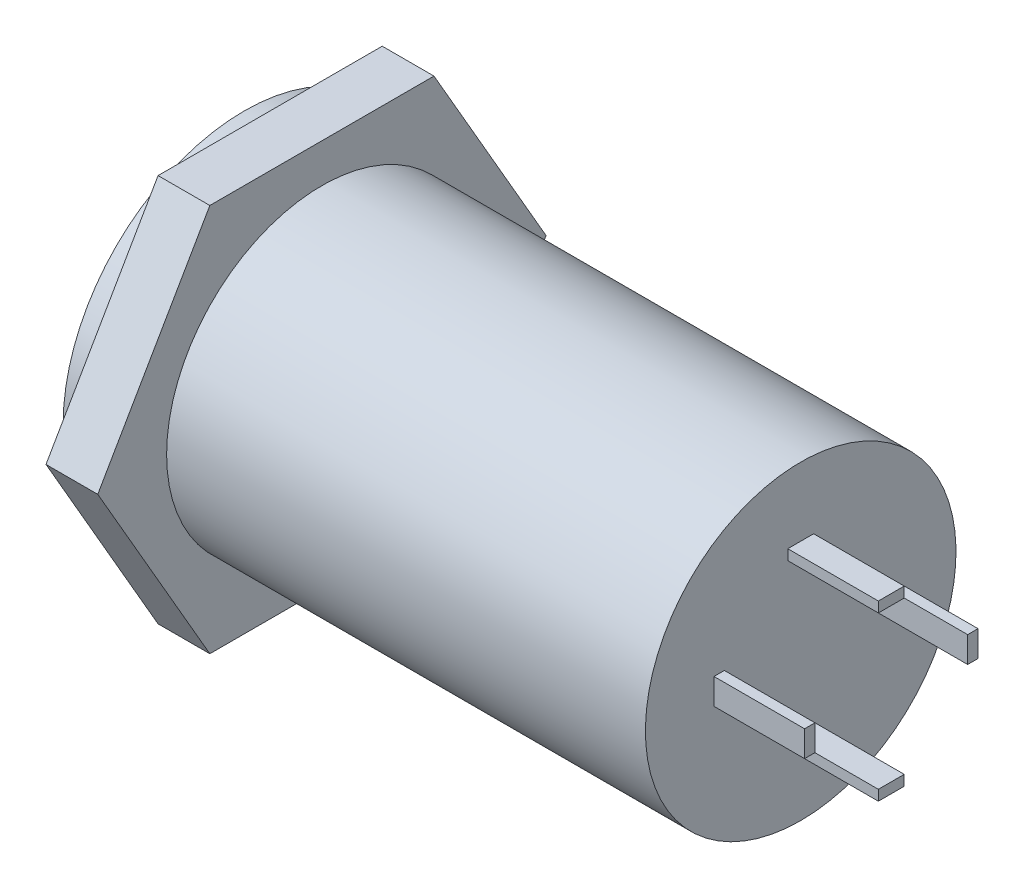
ISO-10303-21;
HEADER;
FILE_DESCRIPTION(('STEP AP214'),'2;1');
FILE_NAME('part.step','',(''),(''),'','','');
FILE_SCHEMA(('AUTOMOTIVE_DESIGN { 1 0 10303 214 1 1 1 1 }'));
ENDSEC;
DATA;
#1=APPLICATION_CONTEXT('core data for automotive mechanical design processes');
#2=APPLICATION_PROTOCOL_DEFINITION('international standard','automotive_design',2000,#1);
#3=PRODUCT_CONTEXT('',#1,'mechanical');
#4=PRODUCT('Part','Part','',(#3));
#5=PRODUCT_RELATED_PRODUCT_CATEGORY('part','',(#4));
#6=PRODUCT_DEFINITION_FORMATION('','',#4);
#7=PRODUCT_DEFINITION_CONTEXT('part definition',#1,'design');
#8=PRODUCT_DEFINITION('design','',#6,#7);
#9=PRODUCT_DEFINITION_SHAPE('','',#8);
#10=(LENGTH_UNIT() NAMED_UNIT(*) SI_UNIT(.MILLI.,.METRE.));
#11=(NAMED_UNIT(*) PLANE_ANGLE_UNIT() SI_UNIT($,.RADIAN.));
#12=(NAMED_UNIT(*) SI_UNIT($,.STERADIAN.) SOLID_ANGLE_UNIT());
#13=UNCERTAINTY_MEASURE_WITH_UNIT(LENGTH_MEASURE(1.E-05),#10,'distance_accuracy_value','');
#14=(GEOMETRIC_REPRESENTATION_CONTEXT(3) GLOBAL_UNCERTAINTY_ASSIGNED_CONTEXT((#13)) GLOBAL_UNIT_ASSIGNED_CONTEXT((#10,
#11,#12)) REPRESENTATION_CONTEXT('',''));
#15=CARTESIAN_POINT('',(0.,0.,0.));
#16=DIRECTION('',(0.,0.,1.));
#17=DIRECTION('',(1.,0.,0.));
#18=AXIS2_PLACEMENT_3D('',#15,#16,#17);
#19=CARTESIAN_POINT('',(181.999927093062,30.1313150027358,44.5613097333414));
#20=DIRECTION('',(-0.999999999998967,-1.43736455550827E-06,-1.04345780020987E-12));
#21=DIRECTION('',(1.43736455550827E-06,-0.999999999998967,0.));
#22=AXIS2_PLACEMENT_3D('',#19,#20,#21);
#23=PLANE('',#22);
#24=DIRECTION('',(0.,7.25952093577634E-07,-0.999999999999737));
#25=VECTOR('',#24,1.);
#26=CARTESIAN_POINT('',(181.999927811709,29.6313387192516,44.5613093703825));
#27=LINE('',#26,#25);
#28=CARTESIAN_POINT('',(181.999927811709,29.6313408608103,41.6113093703833));
#29=VERTEX_POINT('',#28);
#30=CARTESIAN_POINT('',(181.999927811709,29.6313411511911,41.2113093703834));
#31=VERTEX_POINT('',#30);
#32=EDGE_CURVE('E160',#29,#31,#27,.T.);
#33=ORIENTED_EDGE('',*,*,#32,.F.);
#34=DIRECTION('',(1.4373645329524E-06,-0.999999999998703,-7.25952097047067E-07));
#35=VECTOR('',#34,1.);
#36=CARTESIAN_POINT('',(181.999926374379,30.6313171442938,41.6113100963182));
#37=LINE('',#36,#35);
#38=CARTESIAN_POINT('',(181.999926374345,30.631340860809,41.6113100963354));
#39=VERTEX_POINT('',#38);
#40=EDGE_CURVE('E170',#39,#29,#37,.T.);
#41=ORIENTED_EDGE('',*,*,#40,.F.);
#42=DIRECTION('',(0.,-7.25952102251239E-07,0.999999999999737));
#43=VECTOR('',#42,1.);
#44=CARTESIAN_POINT('',(181.999926374345,30.6313387192503,44.5613100963347));
#45=LINE('',#44,#43);
#46=CARTESIAN_POINT('',(181.999926374345,30.6313411511899,41.2113100963355));
#47=VERTEX_POINT('',#46);
#48=EDGE_CURVE('E167',#47,#39,#45,.T.);
#49=ORIENTED_EDGE('',*,*,#48,.F.);
#50=DIRECTION('',(-1.43736450519683E-06,0.999999999998703,7.25952090108173E-07));
#51=VECTOR('',#50,1.);
#52=CARTESIAN_POINT('',(181.999927811743,29.6313174346759,41.2113093703662));
#53=LINE('',#52,#51);
#54=EDGE_CURVE('E163',#31,#47,#53,.T.);
#55=ORIENTED_EDGE('',*,*,#54,.F.);
#56=EDGE_LOOP('',(#33,#41,#49,#55));
#57=FACE_BOUND('',#56,.T.);
#58=DIRECTION('',(0.,-7.25952090108177E-07,0.999999999999737));
#59=VECTOR('',#58,1.);
#60=CARTESIAN_POINT('',(181.999922277856,33.4813387192467,44.5613121652981));
#61=LINE('',#60,#59);
#62=CARTESIAN_POINT('',(181.999922277856,33.4813390822227,44.0613121652983));
#63=VERTEX_POINT('',#62);
#64=CARTESIAN_POINT('',(181.999922277856,33.4813383562706,45.061312165298));
#65=VERTEX_POINT('',#64);
#66=EDGE_CURVE('E174',#63,#65,#61,.T.);
#67=ORIENTED_EDGE('',*,*,#66,.F.);
#68=DIRECTION('',(-1.43736453295242E-06,0.999999999998703,7.25952093577627E-07));
#69=VECTOR('',#68,1.);
#70=CARTESIAN_POINT('',(181.999922852836,33.0813153657081,44.0613118749002));
#71=LINE('',#70,#69);
#72=CARTESIAN_POINT('',(181.999922852802,33.0813390822232,44.0613118749174));
#73=VERTEX_POINT('',#72);
#74=EDGE_CURVE('E184',#73,#63,#71,.T.);
#75=ORIENTED_EDGE('',*,*,#74,.F.);
#76=DIRECTION('',(0.,7.25952097047071E-07,-0.999999999999737));
#77=VECTOR('',#76,1.);
#78=CARTESIAN_POINT('',(181.999922852802,33.0813387192471,44.5613118749173));
#79=LINE('',#78,#77);
#80=CARTESIAN_POINT('',(181.999922852802,33.0813383562711,45.0613118749171));
#81=VERTEX_POINT('',#80);
#82=EDGE_CURVE('E181',#81,#73,#79,.T.);
#83=ORIENTED_EDGE('',*,*,#82,.F.);
#84=DIRECTION('',(1.43736453295239E-06,-0.999999999998703,-7.25952093577615E-07));
#85=VECTOR('',#84,1.);
#86=CARTESIAN_POINT('',(181.99992227789,33.4813146397554,45.0613121652807));
#87=LINE('',#86,#85);
#88=EDGE_CURVE('E177',#65,#81,#87,.T.);
#89=ORIENTED_EDGE('',*,*,#88,.F.);
#90=EDGE_LOOP('',(#67,#75,#83,#89));
#91=FACE_BOUND('',#90,.T.);
#92=CARTESIAN_POINT('',(181.999927093027,30.131338719251,44.5613097333586));
#93=DIRECTION('',(-0.999999999998967,-1.43736455550827E-06,-1.04345780020987E-12));
#94=DIRECTION('',(1.43736455550827E-06,-0.999999999998967,0.));
#95=AXIS2_PLACEMENT_3D('',#92,#93,#94);
#96=CIRCLE('',#95,6.);
#97=CARTESIAN_POINT('',(181.999935717214,24.1313387192572,44.5613097333586));
#98=VERTEX_POINT('',#97);
#99=EDGE_CURVE('E188',#98,#98,#96,.T.);
#100=ORIENTED_EDGE('',*,*,#99,.F.);
#101=EDGE_LOOP('',(#100));
#102=FACE_BOUND('',#101,.T.);
#103=DIRECTION('',(0.,7.2595208490403E-07,-0.999999999999737));
#104=VECTOR('',#103,1.);
#105=CARTESIAN_POINT('',(181.999927811709,29.6313387192516,44.5613093703825));
#106=LINE('',#105,#104);
#107=CARTESIAN_POINT('',(181.999927811709,29.6313362873121,47.9113093703816));
#108=VERTEX_POINT('',#107);
#109=CARTESIAN_POINT('',(181.999927811709,29.6313365776929,47.5113093703817));
#110=VERTEX_POINT('',#109);
#111=EDGE_CURVE('E192',#108,#110,#106,.T.);
#112=ORIENTED_EDGE('',*,*,#111,.F.);
#113=DIRECTION('',(1.4373645329524E-06,-0.999999999998703,-7.25952103985961E-07));
#114=VECTOR('',#113,1.);
#115=CARTESIAN_POINT('',(181.999926374379,30.6313125707957,47.9113100963165));
#116=LINE('',#115,#114);
#117=CARTESIAN_POINT('',(181.999926374345,30.6313362873108,47.9113100963337));
#118=VERTEX_POINT('',#117);
#119=EDGE_CURVE('E202',#118,#108,#116,.T.);
#120=ORIENTED_EDGE('',*,*,#119,.F.);
#121=DIRECTION('',(0.,-7.25952084904017E-07,0.999999999999737));
#122=VECTOR('',#121,1.);
#123=CARTESIAN_POINT('',(181.999926374345,30.6313387192503,44.5613100963347));
#124=LINE('',#123,#122);
#125=CARTESIAN_POINT('',(181.999926374345,30.6313365776916,47.5113100963338));
#126=VERTEX_POINT('',#125);
#127=EDGE_CURVE('E199',#126,#118,#124,.T.);
#128=ORIENTED_EDGE('',*,*,#127,.F.);
#129=DIRECTION('',(-1.43736450519683E-06,0.999999999998703,7.25952090108173E-07));
#130=VECTOR('',#129,1.);
#131=CARTESIAN_POINT('',(181.999927811743,29.6313128611778,47.5113093703645));
#132=LINE('',#131,#130);
#133=EDGE_CURVE('E195',#110,#126,#132,.T.);
#134=ORIENTED_EDGE('',*,*,#133,.F.);
#135=EDGE_LOOP('',(#112,#120,#128,#134));
#136=FACE_BOUND('',#135,.T.);
#137=DIRECTION('',(0.,7.25952090108177E-07,-0.999999999999737));
#138=VECTOR('',#137,1.);
#139=CARTESIAN_POINT('',(181.999931908199,26.7813387192554,44.5613073014191));
#140=LINE('',#139,#138);
#141=CARTESIAN_POINT('',(181.999931908199,26.7813383562793,45.061307301419));
#142=VERTEX_POINT('',#141);
#143=CARTESIAN_POINT('',(181.999931908199,26.7813390822314,44.0613073014192));
#144=VERTEX_POINT('',#143);
#145=EDGE_CURVE('E36',#142,#144,#140,.T.);
#146=ORIENTED_EDGE('',*,*,#145,.F.);
#147=DIRECTION('',(1.43736460234137E-06,-0.999999999998703,-7.25952110924869E-07));
#148=VECTOR('',#147,1.);
#149=CARTESIAN_POINT('',(181.999931333287,27.1813146397636,45.0613075917826));
#150=LINE('',#149,#148);
#151=CARTESIAN_POINT('',(181.999931333253,27.1813383562787,45.0613075917998));
#152=VERTEX_POINT('',#151);
#153=EDGE_CURVE('E213',#152,#142,#150,.T.);
#154=ORIENTED_EDGE('',*,*,#153,.F.);
#155=DIRECTION('',(0.,-7.25952093577624E-07,0.999999999999737));
#156=VECTOR('',#155,1.);
#157=CARTESIAN_POINT('',(181.999931333253,27.1813387192548,44.5613075917999));
#158=LINE('',#157,#156);
#159=CARTESIAN_POINT('',(181.999931333253,27.1813390822308,44.0613075918));
#160=VERTEX_POINT('',#159);
#161=EDGE_CURVE('E210',#160,#152,#158,.T.);
#162=ORIENTED_EDGE('',*,*,#161,.F.);
#163=DIRECTION('',(-1.43736460234135E-06,0.999999999998703,7.25952110924862E-07));
#164=VECTOR('',#163,1.);
#165=CARTESIAN_POINT('',(181.999931908232,26.7813153657162,44.061307301402));
#166=LINE('',#165,#164);
#167=EDGE_CURVE('E207',#144,#160,#166,.T.);
#168=ORIENTED_EDGE('',*,*,#167,.F.);
#169=EDGE_LOOP('',(#146,#154,#162,#168));
#170=FACE_BOUND('',#169,.T.);
#171=ADVANCED_FACE('F17',(#57,#91,#102,#136,#170),#23,.F.);
#172=CARTESIAN_POINT('',(156.499937873305,22.6313052099292,40.2311772697703));
#173=DIRECTION('',(-1.43736455550865E-06,0.999999999998703,7.25952088390623E-07));
#174=DIRECTION('',(-0.999999999998967,-1.43736455550902E-06,0.));
#175=AXIS2_PLACEMENT_3D('',#172,#173,#174);
#176=PLANE('',#175);
#177=DIRECTION('',(0.,-7.25952088391373E-07,0.999999999999737));
#178=VECTOR('',#177,1.);
#179=CARTESIAN_POINT('',(163.499937873302,22.6313080846583,40.2311772697725));
#180=LINE('',#179,#178);
#181=CARTESIAN_POINT('',(163.499937873302,22.6313080846583,40.2311772697725));
#182=VERTEX_POINT('',#181);
#183=CARTESIAN_POINT('',(163.499937873302,22.6313017977288,48.8914313076145));
#184=VERTEX_POINT('',#183);
#185=EDGE_CURVE('E151',#182,#184,#180,.T.);
#186=ORIENTED_EDGE('',*,*,#185,.T.);
#187=DIRECTION('',(0.999999999998967,1.43736455550827E-06,1.04345780031575E-12));
#188=VECTOR('',#187,1.);
#189=CARTESIAN_POINT('',(156.499937873305,22.6312989229997,48.8914313076124));
#190=LINE('',#189,#188);
#191=CARTESIAN_POINT('',(161.499937873305,22.6312989229997,48.8914313076124));
#192=VERTEX_POINT('',#191);
#193=EDGE_CURVE('E27',#192,#184,#190,.T.);
#194=ORIENTED_EDGE('',*,*,#193,.F.);
#195=DIRECTION('',(0.,-7.25952088391373E-07,0.999999999999737));
#196=VECTOR('',#195,1.);
#197=CARTESIAN_POINT('',(161.499937873305,22.6313052099292,40.2311772697703));
#198=LINE('',#197,#196);
#199=CARTESIAN_POINT('',(161.499937873305,22.6313052099292,40.2311772697703));
#200=VERTEX_POINT('',#199);
#201=EDGE_CURVE('E139',#200,#192,#198,.T.);
#202=ORIENTED_EDGE('',*,*,#201,.F.);
#203=DIRECTION('',(0.999999999998967,1.43736455550827E-06,1.04345780031575E-12));
#204=VECTOR('',#203,1.);
#205=CARTESIAN_POINT('',(156.499937873305,22.6313052099292,40.2311772697703));
#206=LINE('',#205,#204);
#207=EDGE_CURVE('E157',#200,#182,#206,.T.);
#208=ORIENTED_EDGE('',*,*,#207,.T.);
#209=EDGE_LOOP('',(#186,#194,#202,#208));
#210=FACE_BOUND('',#209,.T.);
#211=ADVANCED_FACE('F149',(#210),#176,.F.);
#212=CARTESIAN_POINT('',(156.499937873305,22.6312989229998,48.8914313076124));
#213=DIRECTION('',(-7.18682277754329E-07,0.500000628692305,-0.866025040808165));
#214=DIRECTION('',(0.,0.866025040808388,0.500000628692435));
#215=AXIS2_PLACEMENT_3D('',#212,#213,#214);
#216=PLANE('',#215);
#217=DIRECTION('',(-1.24479421766269E-06,0.86602504080727,0.500000628692822));
#218=VECTOR('',#217,1.);
#219=CARTESIAN_POINT('',(163.499937873302,22.6313017977289,48.8914313076145));
#220=LINE('',#219,#218);
#221=CARTESIAN_POINT('',(163.499927093068,30.1312986542544,53.2215637711762));
#222=VERTEX_POINT('',#221);
#223=EDGE_CURVE('E256',#184,#222,#220,.T.);
#224=ORIENTED_EDGE('',*,*,#223,.T.);
#225=DIRECTION('',(0.999999999998967,1.43736455550827E-06,1.04345780031575E-12));
#226=VECTOR('',#225,1.);
#227=CARTESIAN_POINT('',(156.499927093071,30.1312957795253,53.2215637711741));
#228=LINE('',#227,#226);
#229=CARTESIAN_POINT('',(161.49992709307,30.1312957795253,53.2215637711741));
#230=VERTEX_POINT('',#229);
#231=EDGE_CURVE('E136',#230,#222,#228,.T.);
#232=ORIENTED_EDGE('',*,*,#231,.F.);
#233=DIRECTION('',(-1.24479421766269E-06,0.86602504080727,0.500000628692822));
#234=VECTOR('',#233,1.);
#235=CARTESIAN_POINT('',(161.499937873305,22.6312989229998,48.8914313076124));
#236=LINE('',#235,#234);
#237=EDGE_CURVE('E21',#192,#230,#236,.T.);
#238=ORIENTED_EDGE('',*,*,#237,.F.);
#239=ORIENTED_EDGE('',*,*,#193,.T.);
#240=EDGE_LOOP('',(#224,#232,#238,#239));
#241=FACE_BOUND('',#240,.T.);
#242=ADVANCED_FACE('F132',(#241),#216,.F.);
#243=CARTESIAN_POINT('',(156.499927093071,30.1312957795253,53.2215637711741));
#244=DIRECTION('',(7.18682277754319E-07,-0.499999371306399,-0.866025766760256));
#245=DIRECTION('',(0.,0.86602576676048,-0.499999371306528));
#246=AXIS2_PLACEMENT_3D('',#243,#244,#245);
#247=PLANE('',#246);
#248=DIRECTION('',(-1.24479422086763E-06,0.866025766759361,-0.499999371306916));
#249=VECTOR('',#248,1.);
#250=CARTESIAN_POINT('',(163.499927093068,30.1312986542544,53.2215637711762));
#251=LINE('',#250,#249);
#252=CARTESIAN_POINT('',(163.499916312835,37.6313017977095,48.8914421968958));
#253=VERTEX_POINT('',#252);
#254=EDGE_CURVE('E258',#222,#253,#251,.T.);
#255=ORIENTED_EDGE('',*,*,#254,.T.);
#256=DIRECTION('',(0.999999999998967,1.43736455550827E-06,1.04345780031575E-12));
#257=VECTOR('',#256,1.);
#258=CARTESIAN_POINT('',(156.499916312837,37.6312989229803,48.8914421968937));
#259=LINE('',#258,#257);
#260=CARTESIAN_POINT('',(161.499916312836,37.6312989229803,48.8914421968937));
#261=VERTEX_POINT('',#260);
#262=EDGE_CURVE('E153',#261,#253,#259,.T.);
#263=ORIENTED_EDGE('',*,*,#262,.F.);
#264=DIRECTION('',(-1.24479422086763E-06,0.866025766759361,-0.499999371306916));
#265=VECTOR('',#264,1.);
#266=CARTESIAN_POINT('',(161.49992709307,30.1312957795253,53.2215637711741));
#267=LINE('',#266,#265);
#268=EDGE_CURVE('E138',#230,#261,#267,.T.);
#269=ORIENTED_EDGE('',*,*,#268,.F.);
#270=ORIENTED_EDGE('',*,*,#231,.T.);
#271=EDGE_LOOP('',(#255,#263,#269,#270));
#272=FACE_BOUND('',#271,.T.);
#273=ADVANCED_FACE('F277',(#272),#247,.F.);
#274=CARTESIAN_POINT('',(156.499916312837,37.6312989229803,48.8914421968937));
#275=DIRECTION('',(1.43736455550865E-06,-0.999999999998703,-7.25952088390622E-07));
#276=DIRECTION('',(0.999999999998967,1.43736455550902E-06,0.));
#277=AXIS2_PLACEMENT_3D('',#274,#275,#276);
#278=PLANE('',#277);
#279=DIRECTION('',(0.,7.25952088391372E-07,-0.999999999999737));
#280=VECTOR('',#279,1.);
#281=CARTESIAN_POINT('',(163.499916312835,37.6313017977095,48.8914421968958));
#282=LINE('',#281,#280);
#283=CARTESIAN_POINT('',(163.499916312835,37.631308084639,40.2311881590537));
#284=VERTEX_POINT('',#283);
#285=EDGE_CURVE('E260',#253,#284,#282,.T.);
#286=ORIENTED_EDGE('',*,*,#285,.T.);
#287=DIRECTION('',(0.999999999998967,1.43736455550827E-06,1.04345780031575E-12));
#288=VECTOR('',#287,1.);
#289=CARTESIAN_POINT('',(156.499916312837,37.6313052099098,40.2311881590516));
#290=LINE('',#289,#288);
#291=CARTESIAN_POINT('',(161.499916312836,37.6313052099098,40.2311881590516));
#292=VERTEX_POINT('',#291);
#293=EDGE_CURVE('E281',#292,#284,#290,.T.);
#294=ORIENTED_EDGE('',*,*,#293,.F.);
#295=DIRECTION('',(0.,7.25952088391372E-07,-0.999999999999737));
#296=VECTOR('',#295,1.);
#297=CARTESIAN_POINT('',(161.499916312836,37.6312989229803,48.8914421968937));
#298=LINE('',#297,#296);
#299=EDGE_CURVE('E271',#261,#292,#298,.T.);
#300=ORIENTED_EDGE('',*,*,#299,.F.);
#301=ORIENTED_EDGE('',*,*,#262,.T.);
#302=EDGE_LOOP('',(#286,#294,#300,#301));
#303=FACE_BOUND('',#302,.T.);
#304=ADVANCED_FACE('F282',(#303),#278,.F.);
#305=CARTESIAN_POINT('',(156.499916312837,37.6313052099098,40.2311881590516));
#306=DIRECTION('',(7.18682277754324E-07,-0.500000628692303,0.866025040808166));
#307=DIRECTION('',(0.,-0.86602504080839,-0.500000628692432));
#308=AXIS2_PLACEMENT_3D('',#305,#306,#307);
#309=PLANE('',#308);
#310=DIRECTION('',(1.24479421766269E-06,-0.866025040807271,-0.500000628692819));
#311=VECTOR('',#310,1.);
#312=CARTESIAN_POINT('',(163.499916312835,37.631308084639,40.2311881590537));
#313=LINE('',#312,#311);
#314=CARTESIAN_POINT('',(163.499927093068,30.1313112281135,35.901055695492));
#315=VERTEX_POINT('',#314);
#316=EDGE_CURVE('E262',#284,#315,#313,.T.);
#317=ORIENTED_EDGE('',*,*,#316,.T.);
#318=DIRECTION('',(0.999999999998967,1.43736455550827E-06,1.04345780031575E-12));
#319=VECTOR('',#318,1.);
#320=CARTESIAN_POINT('',(156.499927093071,30.1313083533843,35.9010556954899));
#321=LINE('',#320,#319);
#322=CARTESIAN_POINT('',(161.49992709307,30.1313083533843,35.9010556954899));
#323=VERTEX_POINT('',#322);
#324=EDGE_CURVE('E159',#323,#315,#321,.T.);
#325=ORIENTED_EDGE('',*,*,#324,.F.);
#326=DIRECTION('',(1.24479421766269E-06,-0.866025040807271,-0.500000628692819));
#327=VECTOR('',#326,1.);
#328=CARTESIAN_POINT('',(161.499916312836,37.6313052099098,40.2311881590516));
#329=LINE('',#328,#327);
#330=EDGE_CURVE('E269',#292,#323,#329,.T.);
#331=ORIENTED_EDGE('',*,*,#330,.F.);
#332=ORIENTED_EDGE('',*,*,#293,.T.);
#333=EDGE_LOOP('',(#317,#325,#331,#332));
#334=FACE_BOUND('',#333,.T.);
#335=ADVANCED_FACE('F289',(#334),#309,.F.);
#336=CARTESIAN_POINT('',(156.499927093071,30.1313083533843,35.9010556954899));
#337=DIRECTION('',(-7.18682277754321E-07,0.4999993713064,0.866025766760256));
#338=DIRECTION('',(0.,-0.866025766760479,0.499999371306529));
#339=AXIS2_PLACEMENT_3D('',#336,#337,#338);
#340=PLANE('',#339);
#341=DIRECTION('',(1.24479421766269E-06,-0.866025766759361,0.499999371306916));
#342=VECTOR('',#341,1.);
#343=CARTESIAN_POINT('',(163.499927093068,30.1313112281135,35.9010556954919));
#344=LINE('',#343,#342);
#345=EDGE_CURVE('E147',#315,#182,#344,.T.);
#346=ORIENTED_EDGE('',*,*,#345,.T.);
#347=ORIENTED_EDGE('',*,*,#207,.F.);
#348=DIRECTION('',(1.24479421766269E-06,-0.866025766759361,0.499999371306916));
#349=VECTOR('',#348,1.);
#350=CARTESIAN_POINT('',(161.49992709307,30.1313083533843,35.9010556954899));
#351=LINE('',#350,#349);
#352=EDGE_CURVE('E143',#323,#200,#351,.T.);
#353=ORIENTED_EDGE('',*,*,#352,.F.);
#354=ORIENTED_EDGE('',*,*,#324,.T.);
#355=EDGE_LOOP('',(#346,#347,#353,#354));
#356=FACE_BOUND('',#355,.T.);
#357=ADVANCED_FACE('F294',(#356),#340,.F.);
#358=CARTESIAN_POINT('',(161.499970402459,0.00022494751004578,1.63301114697287E-10));
#359=DIRECTION('',(-0.999999999998967,-1.43736455330612E-06,-1.04345779925258E-12));
#360=DIRECTION('',(1.43736455330612E-06,-0.999999999998967,0.));
#361=AXIS2_PLACEMENT_3D('',#358,#359,#360);
#362=PLANE('',#361);
#363=CARTESIAN_POINT('',(161.49992709307,30.1313020664549,44.5613097333321));
#364=DIRECTION('',(-0.999999999998967,-1.43736455550827E-06,-1.04345780046279E-12));
#365=DIRECTION('',(0.,-7.25952088060668E-07,0.999999999999737));
#366=AXIS2_PLACEMENT_3D('',#363,#364,#365);
#367=CIRCLE('',#366,7.);
#368=CARTESIAN_POINT('',(161.49992709307,30.1312969847903,51.5613097333302));
#369=VERTEX_POINT('',#368);
#370=EDGE_CURVE('E11',#369,#369,#367,.T.);
#371=ORIENTED_EDGE('',*,*,#370,.F.);
#372=EDGE_LOOP('',(#371));
#373=FACE_BOUND('',#372,.T.);
#374=ORIENTED_EDGE('',*,*,#201,.T.);
#375=ORIENTED_EDGE('',*,*,#237,.T.);
#376=ORIENTED_EDGE('',*,*,#268,.T.);
#377=ORIENTED_EDGE('',*,*,#299,.T.);
#378=ORIENTED_EDGE('',*,*,#330,.T.);
#379=ORIENTED_EDGE('',*,*,#352,.T.);
#380=EDGE_LOOP('',(#374,#375,#376,#377,#378,#379));
#381=FACE_BOUND('',#380,.T.);
#382=ADVANCED_FACE('F141',(#373,#381),#362,.T.);
#383=CARTESIAN_POINT('',(163.499970402458,0.000227822239156796,1.65388030297918E-10));
#384=DIRECTION('',(-0.999999999998967,-1.43736455330612E-06,-1.04345779925258E-12));
#385=DIRECTION('',(1.43736455330612E-06,-0.999999999998967,0.));
#386=AXIS2_PLACEMENT_3D('',#383,#384,#385);
#387=PLANE('',#386);
#388=CARTESIAN_POINT('',(163.499927093068,30.1313049411839,44.5613097333341));
#389=DIRECTION('',(-0.999999999998967,-1.43736455550827E-06,-1.04345780020987E-12));
#390=DIRECTION('',(-1.04345780020987E-12,0.,1.));
#391=AXIS2_PLACEMENT_3D('',#388,#389,#390);
#392=CIRCLE('',#391,6.);
#393=CARTESIAN_POINT('',(163.499927093062,30.1313049411839,50.561309733334));
#394=VERTEX_POINT('',#393);
#395=EDGE_CURVE('E191',#394,#394,#392,.T.);
#396=ORIENTED_EDGE('',*,*,#395,.T.);
#397=EDGE_LOOP('',(#396));
#398=FACE_BOUND('',#397,.T.);
#399=ORIENTED_EDGE('',*,*,#185,.F.);
#400=ORIENTED_EDGE('',*,*,#345,.F.);
#401=ORIENTED_EDGE('',*,*,#316,.F.);
#402=ORIENTED_EDGE('',*,*,#285,.F.);
#403=ORIENTED_EDGE('',*,*,#254,.F.);
#404=ORIENTED_EDGE('',*,*,#223,.F.);
#405=EDGE_LOOP('',(#399,#400,#401,#402,#403,#404));
#406=FACE_BOUND('',#405,.T.);
#407=ADVANCED_FACE('F296',(#398,#406),#387,.F.);
#408=CARTESIAN_POINT('',(165.499927093062,30.1313150027358,44.5613097333414));
#409=DIRECTION('',(-0.999999999998967,-1.43736455550827E-06,-1.04345780031575E-12));
#410=DIRECTION('',(1.43736455550827E-06,-0.999999999998967,0.));
#411=AXIS2_PLACEMENT_3D('',#408,#409,#410);
#412=CYLINDRICAL_SURFACE('',#411,6.);
#413=ORIENTED_EDGE('',*,*,#99,.T.);
#414=EDGE_LOOP('',(#413));
#415=FACE_BOUND('',#414,.T.);
#416=ORIENTED_EDGE('',*,*,#395,.F.);
#417=EDGE_LOOP('',(#416));
#418=FACE_BOUND('',#417,.T.);
#419=ADVANCED_FACE('F298',(#415,#418),#412,.T.);
#420=CARTESIAN_POINT('',(155.499927093072,30.1313006290904,44.561309733331));
#421=DIRECTION('',(0.999999999998967,1.43736455550827E-06,1.04345780031575E-12));
#422=DIRECTION('',(-1.43736455550827E-06,0.999999999998967,0.));
#423=AXIS2_PLACEMENT_3D('',#420,#421,#422);
#424=CYLINDRICAL_SURFACE('',#423,7.);
#425=CARTESIAN_POINT('',(160.499927093072,30.1313006290904,44.561309733331));
#426=DIRECTION('',(-0.999999999998967,-1.43736455550827E-06,-1.04345780046279E-12));
#427=DIRECTION('',(0.,-7.25952088060668E-07,0.999999999999737));
#428=AXIS2_PLACEMENT_3D('',#425,#426,#427);
#429=CIRCLE('',#428,7.);
#430=CARTESIAN_POINT('',(160.499927093072,30.1312955474257,51.5613097333292));
#431=VERTEX_POINT('',#430);
#432=EDGE_CURVE('E254',#431,#431,#429,.T.);
#433=ORIENTED_EDGE('',*,*,#432,.F.);
#434=EDGE_LOOP('',(#433));
#435=FACE_BOUND('',#434,.T.);
#436=ORIENTED_EDGE('',*,*,#370,.T.);
#437=EDGE_LOOP('',(#436));
#438=FACE_BOUND('',#437,.T.);
#439=ADVANCED_FACE('F306',(#435,#438),#424,.T.);
#440=CARTESIAN_POINT('',(160.499927093072,30.1313006290904,44.561309733331));
#441=DIRECTION('',(-0.999999999998967,-1.43736455550827E-06,-1.04345780046279E-12));
#442=DIRECTION('',(1.43736455550827E-06,-0.999999999998967,0.));
#443=AXIS2_PLACEMENT_3D('',#440,#441,#442);
#444=PLANE('',#443);
#445=ORIENTED_EDGE('',*,*,#432,.T.);
#446=EDGE_LOOP('',(#445));
#447=FACE_BOUND('',#446,.T.);
#448=ADVANCED_FACE('F19',(#447),#444,.T.);
#449=CARTESIAN_POINT('',(169.199922277886,33.4813206839564,44.0613121652849));
#450=DIRECTION('',(1.43736455550865E-06,-0.999999999998703,-7.25952090107428E-07));
#451=DIRECTION('',(0.999999999998967,1.43736455550903E-06,0.));
#452=AXIS2_PLACEMENT_3D('',#449,#450,#451);
#453=PLANE('',#452);
#454=ORIENTED_EDGE('',*,*,#66,.T.);
#455=DIRECTION('',(-0.999999999998967,-1.43736455550827E-06,-1.04345780020987E-12));
#456=VECTOR('',#455,1.);
#457=CARTESIAN_POINT('',(169.199922277886,33.4813199580043,45.0613121652846));
#458=LINE('',#457,#456);
#459=CARTESIAN_POINT('',(185.499922277852,33.4813436745195,45.0613121653018));
#460=VERTEX_POINT('',#459);
#461=EDGE_CURVE('E266',#460,#65,#458,.T.);
#462=ORIENTED_EDGE('',*,*,#461,.F.);
#463=DIRECTION('',(0.,-7.25952090108178E-07,0.999999999999737));
#464=VECTOR('',#463,1.);
#465=CARTESIAN_POINT('',(185.499922277852,33.4813444004716,44.0613121653021));
#466=LINE('',#465,#464);
#467=CARTESIAN_POINT('',(185.499922277852,33.4813444004716,44.0613121653021));
#468=VERTEX_POINT('',#467);
#469=EDGE_CURVE('E187',#468,#460,#466,.T.);
#470=ORIENTED_EDGE('',*,*,#469,.F.);
#471=DIRECTION('',(-0.999999999998967,-1.43736455550827E-06,-1.04345780020987E-12));
#472=VECTOR('',#471,1.);
#473=CARTESIAN_POINT('',(169.199922277886,33.4813206839564,44.0613121652849));
#474=LINE('',#473,#472);
#475=EDGE_CURVE('E248',#468,#63,#474,.T.);
#476=ORIENTED_EDGE('',*,*,#475,.T.);
#477=EDGE_LOOP('',(#454,#462,#470,#476));
#478=FACE_BOUND('',#477,.T.);
#479=ADVANCED_FACE('F399',(#478),#453,.F.);
#480=CARTESIAN_POINT('',(169.199922277886,33.4813199580043,45.0613121652846));
#481=DIRECTION('',(0.,7.25952093578365E-07,-0.999999999999737));
#482=DIRECTION('',(0.,0.999999999999737,7.25952093578365E-07));
#483=AXIS2_PLACEMENT_3D('',#480,#481,#482);
#484=PLANE('',#483);
#485=ORIENTED_EDGE('',*,*,#88,.T.);
#486=DIRECTION('',(-0.999999999998967,-1.43736455550827E-06,-1.04345780020987E-12));
#487=VECTOR('',#486,1.);
#488=CARTESIAN_POINT('',(169.199922852832,33.0813199580048,45.0613118749038));
#489=LINE('',#488,#487);
#490=CARTESIAN_POINT('',(185.499922852798,33.0813436745199,45.061311874921));
#491=VERTEX_POINT('',#490);
#492=EDGE_CURVE('E389',#491,#81,#489,.T.);
#493=ORIENTED_EDGE('',*,*,#492,.F.);
#494=DIRECTION('',(1.43736453295239E-06,-0.999999999998703,-7.25952093577615E-07));
#495=VECTOR('',#494,1.);
#496=CARTESIAN_POINT('',(185.499922277886,33.4813199580043,45.0613121652846));
#497=LINE('',#496,#495);
#498=EDGE_CURVE('E245',#460,#491,#497,.T.);
#499=ORIENTED_EDGE('',*,*,#498,.F.);
#500=ORIENTED_EDGE('',*,*,#461,.T.);
#501=EDGE_LOOP('',(#485,#493,#499,#500));
#502=FACE_BOUND('',#501,.T.);
#503=ADVANCED_FACE('F419',(#502),#484,.F.);
#504=CARTESIAN_POINT('',(169.199922852832,33.0813199580048,45.0613118749038));
#505=DIRECTION('',(-1.43736455550865E-06,0.999999999998703,7.25952097046321E-07));
#506=DIRECTION('',(-0.999999999998967,-1.43736455550903E-06,0.));
#507=AXIS2_PLACEMENT_3D('',#504,#505,#506);
#508=PLANE('',#507);
#509=ORIENTED_EDGE('',*,*,#82,.T.);
#510=DIRECTION('',(-0.999999999998967,-1.43736455550827E-06,-1.04345780020987E-12));
#511=VECTOR('',#510,1.);
#512=CARTESIAN_POINT('',(169.199922852832,33.0813206839569,44.061311874904));
#513=LINE('',#512,#511);
#514=CARTESIAN_POINT('',(185.499922852798,33.081344400472,44.0613118749213));
#515=VERTEX_POINT('',#514);
#516=EDGE_CURVE('E386',#515,#73,#513,.T.);
#517=ORIENTED_EDGE('',*,*,#516,.F.);
#518=DIRECTION('',(0.,7.25952097047071E-07,-0.999999999999737));
#519=VECTOR('',#518,1.);
#520=CARTESIAN_POINT('',(185.499922852798,33.0813436745199,45.061311874921));
#521=LINE('',#520,#519);
#522=EDGE_CURVE('E249',#491,#515,#521,.T.);
#523=ORIENTED_EDGE('',*,*,#522,.F.);
#524=ORIENTED_EDGE('',*,*,#492,.T.);
#525=EDGE_LOOP('',(#509,#517,#523,#524));
#526=FACE_BOUND('',#525,.T.);
#527=ADVANCED_FACE('F414',(#526),#508,.F.);
#528=CARTESIAN_POINT('',(169.199922852832,33.0813206839569,44.061311874904));
#529=DIRECTION('',(0.,-7.25952093578378E-07,0.999999999999737));
#530=DIRECTION('',(0.,-0.999999999999737,-7.25952093578378E-07));
#531=AXIS2_PLACEMENT_3D('',#528,#529,#530);
#532=PLANE('',#531);
#533=ORIENTED_EDGE('',*,*,#74,.T.);
#534=ORIENTED_EDGE('',*,*,#475,.F.);
#535=DIRECTION('',(-1.43736453295242E-06,0.999999999998703,7.25952093577627E-07));
#536=VECTOR('',#535,1.);
#537=CARTESIAN_POINT('',(185.499922852832,33.0813206839569,44.061311874904));
#538=LINE('',#537,#536);
#539=EDGE_CURVE('E246',#515,#468,#538,.T.);
#540=ORIENTED_EDGE('',*,*,#539,.F.);
#541=ORIENTED_EDGE('',*,*,#516,.T.);
#542=EDGE_LOOP('',(#533,#534,#540,#541));
#543=FACE_BOUND('',#542,.T.);
#544=ADVANCED_FACE('F332',(#543),#532,.F.);
#545=CARTESIAN_POINT('',(185.499970402445,0.000243202036516715,1.76553026716417E-10));
#546=DIRECTION('',(0.999999999998967,1.43736453295201E-06,1.04345778694415E-12));
#547=DIRECTION('',(-1.43736453295201E-06,0.999999999998967,0.));
#548=AXIS2_PLACEMENT_3D('',#545,#546,#547);
#549=PLANE('',#548);
#550=ORIENTED_EDGE('',*,*,#469,.T.);
#551=ORIENTED_EDGE('',*,*,#498,.T.);
#552=ORIENTED_EDGE('',*,*,#522,.T.);
#553=ORIENTED_EDGE('',*,*,#539,.T.);
#554=EDGE_LOOP('',(#550,#551,#552,#553));
#555=FACE_BOUND('',#554,.T.);
#556=ADVANCED_FACE('F328',(#555),#549,.T.);
#557=CARTESIAN_POINT('',(169.19992781174,29.6313178890458,47.9113093703683));
#558=DIRECTION('',(-1.43736455550865E-06,0.999999999998703,7.2595208490328E-07));
#559=DIRECTION('',(-0.999999999998967,-1.43736455550903E-06,0.));
#560=AXIS2_PLACEMENT_3D('',#557,#558,#559);
#561=PLANE('',#560);
#562=ORIENTED_EDGE('',*,*,#111,.T.);
#563=DIRECTION('',(-0.999999999998967,-1.43736455550827E-06,-1.04345780020987E-12));
#564=VECTOR('',#563,1.);
#565=CARTESIAN_POINT('',(169.19992781174,29.6313181794266,47.5113093703684));
#566=LINE('',#565,#564);
#567=CARTESIAN_POINT('',(185.499927811705,29.6313418959418,47.5113093703856));
#568=VERTEX_POINT('',#567);
#569=EDGE_CURVE('E178',#568,#110,#566,.T.);
#570=ORIENTED_EDGE('',*,*,#569,.F.);
#571=DIRECTION('',(0.,7.2595208490403E-07,-0.999999999999737));
#572=VECTOR('',#571,1.);
#573=CARTESIAN_POINT('',(185.499927811705,29.631341605561,47.9113093703855));
#574=LINE('',#573,#572);
#575=CARTESIAN_POINT('',(185.499927811705,29.631341605561,47.9113093703855));
#576=VERTEX_POINT('',#575);
#577=EDGE_CURVE('E205',#576,#568,#574,.T.);
#578=ORIENTED_EDGE('',*,*,#577,.F.);
#579=DIRECTION('',(-0.999999999998967,-1.43736455550827E-06,-1.04345780020987E-12));
#580=VECTOR('',#579,1.);
#581=CARTESIAN_POINT('',(169.19992781174,29.6313178890458,47.9113093703683));
#582=LINE('',#581,#580);
#583=EDGE_CURVE('E221',#576,#108,#582,.T.);
#584=ORIENTED_EDGE('',*,*,#583,.T.);
#585=EDGE_LOOP('',(#562,#570,#578,#584));
#586=FACE_BOUND('',#585,.T.);
#587=ADVANCED_FACE('F331',(#586),#561,.F.);
#588=CARTESIAN_POINT('',(169.19992781174,29.6313181794266,47.5113093703684));
#589=DIRECTION('',(0.,-7.25952090108923E-07,0.999999999999737));
#590=DIRECTION('',(0.,-0.999999999999737,-7.25952090108923E-07));
#591=AXIS2_PLACEMENT_3D('',#588,#589,#590);
#592=PLANE('',#591);
#593=ORIENTED_EDGE('',*,*,#133,.T.);
#594=DIRECTION('',(-0.999999999998967,-1.43736455550827E-06,-1.04345780020987E-12));
#595=VECTOR('',#594,1.);
#596=CARTESIAN_POINT('',(169.199926374375,30.6313181794253,47.5113100963205));
#597=LINE('',#596,#595);
#598=CARTESIAN_POINT('',(185.499926374341,30.6313418959405,47.5113100963377));
#599=VERTEX_POINT('',#598);
#600=EDGE_CURVE('E379',#599,#126,#597,.T.);
#601=ORIENTED_EDGE('',*,*,#600,.F.);
#602=DIRECTION('',(-1.43736450519683E-06,0.999999999998703,7.25952090108173E-07));
#603=VECTOR('',#602,1.);
#604=CARTESIAN_POINT('',(185.499927811739,29.6313181794266,47.5113093703684));
#605=LINE('',#604,#603);
#606=EDGE_CURVE('E218',#568,#599,#605,.T.);
#607=ORIENTED_EDGE('',*,*,#606,.F.);
#608=ORIENTED_EDGE('',*,*,#569,.T.);
#609=EDGE_LOOP('',(#593,#601,#607,#608));
#610=FACE_BOUND('',#609,.T.);
#611=ADVANCED_FACE('F471',(#610),#592,.F.);
#612=CARTESIAN_POINT('',(169.199926374375,30.6313181794253,47.5113100963205));
#613=DIRECTION('',(1.43736455550865E-06,-0.999999999998703,-7.25952084903267E-07));
#614=DIRECTION('',(0.999999999998967,1.43736455550903E-06,0.));
#615=AXIS2_PLACEMENT_3D('',#612,#613,#614);
#616=PLANE('',#615);
#617=ORIENTED_EDGE('',*,*,#127,.T.);
#618=DIRECTION('',(-0.999999999998967,-1.43736455550827E-06,-1.04345780020987E-12));
#619=VECTOR('',#618,1.);
#620=CARTESIAN_POINT('',(169.199926374375,30.6313178890445,47.9113100963204));
#621=LINE('',#620,#619);
#622=CARTESIAN_POINT('',(185.499926374341,30.6313416055597,47.9113100963376));
#623=VERTEX_POINT('',#622);
#624=EDGE_CURVE('E376',#623,#118,#621,.T.);
#625=ORIENTED_EDGE('',*,*,#624,.F.);
#626=DIRECTION('',(0.,-7.25952084904017E-07,0.999999999999737));
#627=VECTOR('',#626,1.);
#628=CARTESIAN_POINT('',(185.499926374341,30.6313418959405,47.5113100963377));
#629=LINE('',#628,#627);
#630=EDGE_CURVE('E222',#599,#623,#629,.T.);
#631=ORIENTED_EDGE('',*,*,#630,.F.);
#632=ORIENTED_EDGE('',*,*,#600,.T.);
#633=EDGE_LOOP('',(#617,#625,#631,#632));
#634=FACE_BOUND('',#633,.T.);
#635=ADVANCED_FACE('F467',(#634),#616,.F.);
#636=CARTESIAN_POINT('',(169.199926374375,30.6313178890445,47.9113100963204));
#637=DIRECTION('',(0.,7.25952103986711E-07,-0.999999999999737));
#638=DIRECTION('',(0.,0.999999999999737,7.25952103986711E-07));
#639=AXIS2_PLACEMENT_3D('',#636,#637,#638);
#640=PLANE('',#639);
#641=ORIENTED_EDGE('',*,*,#119,.T.);
#642=ORIENTED_EDGE('',*,*,#583,.F.);
#643=DIRECTION('',(1.4373645329524E-06,-0.999999999998703,-7.25952103985961E-07));
#644=VECTOR('',#643,1.);
#645=CARTESIAN_POINT('',(185.499926374375,30.6313178890445,47.9113100963204));
#646=LINE('',#645,#644);
#647=EDGE_CURVE('E219',#623,#576,#646,.T.);
#648=ORIENTED_EDGE('',*,*,#647,.F.);
#649=ORIENTED_EDGE('',*,*,#624,.T.);
#650=EDGE_LOOP('',(#641,#642,#648,#649));
#651=FACE_BOUND('',#650,.T.);
#652=ADVANCED_FACE('F326',(#651),#640,.F.);
#653=CARTESIAN_POINT('',(185.499970402444,0.000243202031923169,1.76553022143741E-10));
#654=DIRECTION('',(0.999999999998967,1.43736450519645E-06,1.04345775931468E-12));
#655=DIRECTION('',(-1.43736450519645E-06,0.999999999998967,0.));
#656=AXIS2_PLACEMENT_3D('',#653,#654,#655);
#657=PLANE('',#656);
#658=ORIENTED_EDGE('',*,*,#577,.T.);
#659=ORIENTED_EDGE('',*,*,#606,.T.);
#660=ORIENTED_EDGE('',*,*,#630,.T.);
#661=ORIENTED_EDGE('',*,*,#647,.T.);
#662=EDGE_LOOP('',(#658,#659,#660,#661));
#663=FACE_BOUND('',#662,.T.);
#664=ADVANCED_FACE('F322',(#663),#657,.T.);
#665=CARTESIAN_POINT('',(169.19992781174,29.631322462544,41.61130937037));
#666=DIRECTION('',(-1.43736455550865E-06,0.999999999998703,7.25952093576885E-07));
#667=DIRECTION('',(-0.999999999998967,-1.43736455550903E-06,0.));
#668=AXIS2_PLACEMENT_3D('',#665,#666,#667);
#669=PLANE('',#668);
#670=ORIENTED_EDGE('',*,*,#32,.T.);
#671=DIRECTION('',(-0.999999999998967,-1.43736455550827E-06,-1.04345780020987E-12));
#672=VECTOR('',#671,1.);
#673=CARTESIAN_POINT('',(169.19992781174,29.6313227529248,41.21130937037));
#674=LINE('',#673,#672);
#675=CARTESIAN_POINT('',(185.499927811705,29.63134646944,41.2113093703872));
#676=VERTEX_POINT('',#675);
#677=EDGE_CURVE('E196',#676,#31,#674,.T.);
#678=ORIENTED_EDGE('',*,*,#677,.F.);
#679=DIRECTION('',(0.,7.25952093577635E-07,-0.999999999999737));
#680=VECTOR('',#679,1.);
#681=CARTESIAN_POINT('',(185.499927811705,29.6313461790592,41.6113093703871));
#682=LINE('',#681,#680);
#683=CARTESIAN_POINT('',(185.499927811705,29.6313461790592,41.6113093703871));
#684=VERTEX_POINT('',#683);
#685=EDGE_CURVE('E173',#684,#676,#682,.T.);
#686=ORIENTED_EDGE('',*,*,#685,.F.);
#687=DIRECTION('',(-0.999999999998967,-1.43736455550827E-06,-1.04345780020987E-12));
#688=VECTOR('',#687,1.);
#689=CARTESIAN_POINT('',(169.19992781174,29.631322462544,41.61130937037));
#690=LINE('',#689,#688);
#691=EDGE_CURVE('E239',#684,#29,#690,.T.);
#692=ORIENTED_EDGE('',*,*,#691,.T.);
#693=EDGE_LOOP('',(#670,#678,#686,#692));
#694=FACE_BOUND('',#693,.T.);
#695=ADVANCED_FACE('F325',(#694),#669,.F.);
#696=CARTESIAN_POINT('',(169.19992781174,29.6313227529248,41.21130937037));
#697=DIRECTION('',(0.,-7.25952090108923E-07,0.999999999999737));
#698=DIRECTION('',(0.,-0.999999999999737,-7.25952090108923E-07));
#699=AXIS2_PLACEMENT_3D('',#696,#697,#698);
#700=PLANE('',#699);
#701=ORIENTED_EDGE('',*,*,#54,.T.);
#702=DIRECTION('',(-0.999999999998967,-1.43736455550827E-06,-1.04345780020987E-12));
#703=VECTOR('',#702,1.);
#704=CARTESIAN_POINT('',(169.199926374375,30.6313227529235,41.2113100963222));
#705=LINE('',#704,#703);
#706=CARTESIAN_POINT('',(185.499926374341,30.6313464694387,41.2113100963394));
#707=VERTEX_POINT('',#706);
#708=EDGE_CURVE('E369',#707,#47,#705,.T.);
#709=ORIENTED_EDGE('',*,*,#708,.F.);
#710=DIRECTION('',(-1.43736450519683E-06,0.999999999998703,7.25952090108173E-07));
#711=VECTOR('',#710,1.);
#712=CARTESIAN_POINT('',(185.499927811739,29.6313227529248,41.21130937037));
#713=LINE('',#712,#711);
#714=EDGE_CURVE('E236',#676,#707,#713,.T.);
#715=ORIENTED_EDGE('',*,*,#714,.F.);
#716=ORIENTED_EDGE('',*,*,#677,.T.);
#717=EDGE_LOOP('',(#701,#709,#715,#716));
#718=FACE_BOUND('',#717,.T.);
#719=ADVANCED_FACE('F457',(#718),#700,.F.);
#720=CARTESIAN_POINT('',(169.199926374375,30.6313227529236,41.2113100963222));
#721=DIRECTION('',(1.43736455550865E-06,-0.999999999998703,-7.25952102250489E-07));
#722=DIRECTION('',(0.999999999998967,1.43736455550903E-06,0.));
#723=AXIS2_PLACEMENT_3D('',#720,#721,#722);
#724=PLANE('',#723);
#725=ORIENTED_EDGE('',*,*,#48,.T.);
#726=DIRECTION('',(-0.999999999998967,-1.43736455550827E-06,-1.04345780020987E-12));
#727=VECTOR('',#726,1.);
#728=CARTESIAN_POINT('',(169.199926374375,30.6313224625427,41.611310096322));
#729=LINE('',#728,#727);
#730=CARTESIAN_POINT('',(185.499926374341,30.6313461790579,41.6113100963392));
#731=VERTEX_POINT('',#730);
#732=EDGE_CURVE('E366',#731,#39,#729,.T.);
#733=ORIENTED_EDGE('',*,*,#732,.F.);
#734=DIRECTION('',(0.,-7.25952102251239E-07,0.999999999999737));
#735=VECTOR('',#734,1.);
#736=CARTESIAN_POINT('',(185.499926374341,30.6313464694387,41.2113100963394));
#737=LINE('',#736,#735);
#738=EDGE_CURVE('E240',#707,#731,#737,.T.);
#739=ORIENTED_EDGE('',*,*,#738,.F.);
#740=ORIENTED_EDGE('',*,*,#708,.T.);
#741=EDGE_LOOP('',(#725,#733,#739,#740));
#742=FACE_BOUND('',#741,.T.);
#743=ADVANCED_FACE('F453',(#742),#724,.F.);
#744=CARTESIAN_POINT('',(169.199926374375,30.6313224625427,41.611310096322));
#745=DIRECTION('',(0.,7.25952097047817E-07,-0.999999999999737));
#746=DIRECTION('',(0.,0.999999999999737,7.25952097047817E-07));
#747=AXIS2_PLACEMENT_3D('',#744,#745,#746);
#748=PLANE('',#747);
#749=ORIENTED_EDGE('',*,*,#40,.T.);
#750=ORIENTED_EDGE('',*,*,#691,.F.);
#751=DIRECTION('',(1.4373645329524E-06,-0.999999999998703,-7.25952097047067E-07));
#752=VECTOR('',#751,1.);
#753=CARTESIAN_POINT('',(185.499926374375,30.6313224625427,41.611310096322));
#754=LINE('',#753,#752);
#755=EDGE_CURVE('E237',#731,#684,#754,.T.);
#756=ORIENTED_EDGE('',*,*,#755,.F.);
#757=ORIENTED_EDGE('',*,*,#732,.T.);
#758=EDGE_LOOP('',(#749,#750,#756,#757));
#759=FACE_BOUND('',#758,.T.);
#760=ADVANCED_FACE('F337',(#759),#748,.F.);
#761=CARTESIAN_POINT('',(185.499970402444,0.000243202031923169,1.7655302420705E-10));
#762=DIRECTION('',(0.999999999998967,1.43736450519645E-06,1.04345777178182E-12));
#763=DIRECTION('',(-1.43736450519645E-06,0.999999999998967,0.));
#764=AXIS2_PLACEMENT_3D('',#761,#762,#763);
#765=PLANE('',#764);
#766=ORIENTED_EDGE('',*,*,#685,.T.);
#767=ORIENTED_EDGE('',*,*,#714,.T.);
#768=ORIENTED_EDGE('',*,*,#738,.T.);
#769=ORIENTED_EDGE('',*,*,#755,.T.);
#770=EDGE_LOOP('',(#766,#767,#768,#769));
#771=FACE_BOUND('',#770,.T.);
#772=ADVANCED_FACE('F334',(#771),#765,.T.);
#773=CARTESIAN_POINT('',(169.199931908228,26.7813199580129,45.0613073014056));
#774=DIRECTION('',(-1.43736455550865E-06,0.999999999998703,7.25952090107428E-07));
#775=DIRECTION('',(-0.999999999998967,-1.43736455550903E-06,0.));
#776=AXIS2_PLACEMENT_3D('',#773,#774,#775);
#777=PLANE('',#776);
#778=ORIENTED_EDGE('',*,*,#145,.T.);
#779=DIRECTION('',(-0.999999999998967,-1.43736455550827E-06,-1.04345780020987E-12));
#780=VECTOR('',#779,1.);
#781=CARTESIAN_POINT('',(169.199931908228,26.781320683965,44.0613073014058));
#782=LINE('',#781,#780);
#783=CARTESIAN_POINT('',(185.499931908194,26.7813444004803,44.0613073014231));
#784=VERTEX_POINT('',#783);
#785=EDGE_CURVE('E164',#784,#144,#782,.T.);
#786=ORIENTED_EDGE('',*,*,#785,.F.);
#787=DIRECTION('',(0.,7.25952090108178E-07,-0.999999999999737));
#788=VECTOR('',#787,1.);
#789=CARTESIAN_POINT('',(185.499931908194,26.7813436745282,45.0613073014228));
#790=LINE('',#789,#788);
#791=CARTESIAN_POINT('',(185.499931908194,26.7813436745282,45.0613073014228));
#792=VERTEX_POINT('',#791);
#793=EDGE_CURVE('E215',#792,#784,#790,.T.);
#794=ORIENTED_EDGE('',*,*,#793,.F.);
#795=DIRECTION('',(-0.999999999998967,-1.43736455550827E-06,-1.04345780020987E-12));
#796=VECTOR('',#795,1.);
#797=CARTESIAN_POINT('',(169.199931908228,26.7813199580129,45.0613073014056));
#798=LINE('',#797,#796);
#799=EDGE_CURVE('E230',#792,#142,#798,.T.);
#800=ORIENTED_EDGE('',*,*,#799,.T.);
#801=EDGE_LOOP('',(#778,#786,#794,#800));
#802=FACE_BOUND('',#801,.T.);
#803=ADVANCED_FACE('F336',(#802),#777,.F.);
#804=CARTESIAN_POINT('',(169.199931908228,26.781320683965,44.0613073014058));
#805=DIRECTION('',(0.,-7.25952110925612E-07,0.999999999999737));
#806=DIRECTION('',(0.,-0.999999999999737,-7.25952110925612E-07));
#807=AXIS2_PLACEMENT_3D('',#804,#805,#806);
#808=PLANE('',#807);
#809=ORIENTED_EDGE('',*,*,#167,.T.);
#810=DIRECTION('',(-0.999999999998967,-1.43736455550827E-06,-1.04345780020987E-12));
#811=VECTOR('',#810,1.);
#812=CARTESIAN_POINT('',(169.199931333283,27.1813206839646,44.0613075917867));
#813=LINE('',#812,#811);
#814=CARTESIAN_POINT('',(185.499931333249,27.1813444004797,44.0613075918039));
#815=VERTEX_POINT('',#814);
#816=EDGE_CURVE('E358',#815,#160,#813,.T.);
#817=ORIENTED_EDGE('',*,*,#816,.F.);
#818=DIRECTION('',(-1.43736460234135E-06,0.999999999998703,7.25952110924862E-07));
#819=VECTOR('',#818,1.);
#820=CARTESIAN_POINT('',(185.499931908228,26.781320683965,44.0613073014058));
#821=LINE('',#820,#819);
#822=EDGE_CURVE('E227',#784,#815,#821,.T.);
#823=ORIENTED_EDGE('',*,*,#822,.F.);
#824=ORIENTED_EDGE('',*,*,#785,.T.);
#825=EDGE_LOOP('',(#809,#817,#823,#824));
#826=FACE_BOUND('',#825,.T.);
#827=ADVANCED_FACE('F440',(#826),#808,.F.);
#828=CARTESIAN_POINT('',(169.199931333283,27.1813206839646,44.0613075917867));
#829=DIRECTION('',(1.43736455550865E-06,-0.999999999998703,-7.25952093576874E-07));
#830=DIRECTION('',(0.999999999998967,1.43736455550903E-06,0.));
#831=AXIS2_PLACEMENT_3D('',#828,#829,#830);
#832=PLANE('',#831);
#833=ORIENTED_EDGE('',*,*,#161,.T.);
#834=DIRECTION('',(-0.999999999998967,-1.43736455550827E-06,-1.04345780020987E-12));
#835=VECTOR('',#834,1.);
#836=CARTESIAN_POINT('',(169.199931333283,27.1813199580124,45.0613075917864));
#837=LINE('',#836,#835);
#838=CARTESIAN_POINT('',(185.499931333249,27.1813436745276,45.0613075918037));
#839=VERTEX_POINT('',#838);
#840=EDGE_CURVE('E361',#839,#152,#837,.T.);
#841=ORIENTED_EDGE('',*,*,#840,.F.);
#842=DIRECTION('',(0.,-7.25952093577625E-07,0.999999999999737));
#843=VECTOR('',#842,1.);
#844=CARTESIAN_POINT('',(185.499931333249,27.1813444004797,44.0613075918039));
#845=LINE('',#844,#843);
#846=EDGE_CURVE('E231',#815,#839,#845,.T.);
#847=ORIENTED_EDGE('',*,*,#846,.F.);
#848=ORIENTED_EDGE('',*,*,#816,.T.);
#849=EDGE_LOOP('',(#833,#841,#847,#848));
#850=FACE_BOUND('',#849,.T.);
#851=ADVANCED_FACE('F346',(#850),#832,.F.);
#852=CARTESIAN_POINT('',(169.199931333283,27.1813199580124,45.0613075917864));
#853=DIRECTION('',(0.,7.25952110925619E-07,-0.999999999999737));
#854=DIRECTION('',(0.,0.999999999999737,7.25952110925619E-07));
#855=AXIS2_PLACEMENT_3D('',#852,#853,#854);
#856=PLANE('',#855);
#857=ORIENTED_EDGE('',*,*,#153,.T.);
#858=ORIENTED_EDGE('',*,*,#799,.F.);
#859=DIRECTION('',(1.43736460234137E-06,-0.999999999998703,-7.25952110924869E-07));
#860=VECTOR('',#859,1.);
#861=CARTESIAN_POINT('',(185.499931333283,27.1813199580124,45.0613075917864));
#862=LINE('',#861,#860);
#863=EDGE_CURVE('E228',#839,#792,#862,.T.);
#864=ORIENTED_EDGE('',*,*,#863,.F.);
#865=ORIENTED_EDGE('',*,*,#840,.T.);
#866=EDGE_LOOP('',(#857,#858,#864,#865));
#867=FACE_BOUND('',#866,.T.);
#868=ADVANCED_FACE('F341',(#867),#856,.F.);
#869=CARTESIAN_POINT('',(185.499970402447,0.000243202048000589,1.7655303505316E-10));
#870=DIRECTION('',(0.999999999998967,1.43736460234098E-06,1.04345783731722E-12));
#871=DIRECTION('',(-1.43736460234098E-06,0.999999999998967,0.));
#872=AXIS2_PLACEMENT_3D('',#869,#870,#871);
#873=PLANE('',#872);
#874=ORIENTED_EDGE('',*,*,#793,.T.);
#875=ORIENTED_EDGE('',*,*,#822,.T.);
#876=ORIENTED_EDGE('',*,*,#846,.T.);
#877=ORIENTED_EDGE('',*,*,#863,.T.);
#878=EDGE_LOOP('',(#874,#875,#876,#877));
#879=FACE_BOUND('',#878,.T.);
#880=ADVANCED_FACE('F339',(#879),#873,.T.);
#881=CLOSED_SHELL('',(#171,#211,#242,#273,#304,#335,#357,#382,#407,#419,#439,#448,#479,#503,
#527,#544,#556,#587,#611,#635,#652,#664,#695,#719,#743,#760,#772,#803,#827,#851,#868,#880));
#882=MANIFOLD_SOLID_BREP('B1',#881);
#883=ADVANCED_BREP_SHAPE_REPRESENTATION('',(#18,#882),#14);
#884=SHAPE_DEFINITION_REPRESENTATION(#9,#883);
ENDSEC;
END-ISO-10303-21;
